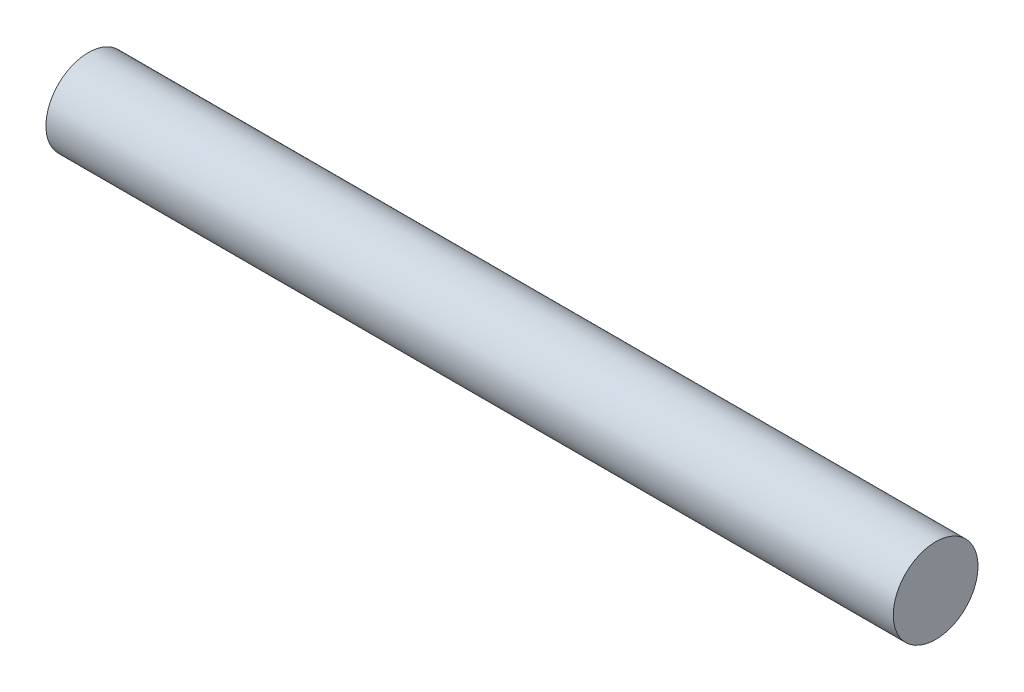
ISO-10303-21;
HEADER;
FILE_DESCRIPTION(('STEP AP214'),'2;1');
FILE_NAME('part.step','',(''),(''),'','','');
FILE_SCHEMA(('AUTOMOTIVE_DESIGN { 1 0 10303 214 1 1 1 1 }'));
ENDSEC;
DATA;
#1=APPLICATION_CONTEXT('core data for automotive mechanical design processes');
#2=APPLICATION_PROTOCOL_DEFINITION('international standard','automotive_design',2000,#1);
#3=PRODUCT_CONTEXT('',#1,'mechanical');
#4=PRODUCT('Part','Part','',(#3));
#5=PRODUCT_RELATED_PRODUCT_CATEGORY('part','',(#4));
#6=PRODUCT_DEFINITION_FORMATION('','',#4);
#7=PRODUCT_DEFINITION_CONTEXT('part definition',#1,'design');
#8=PRODUCT_DEFINITION('design','',#6,#7);
#9=PRODUCT_DEFINITION_SHAPE('','',#8);
#10=(LENGTH_UNIT() NAMED_UNIT(*) SI_UNIT(.MILLI.,.METRE.));
#11=(NAMED_UNIT(*) PLANE_ANGLE_UNIT() SI_UNIT($,.RADIAN.));
#12=(NAMED_UNIT(*) SI_UNIT($,.STERADIAN.) SOLID_ANGLE_UNIT());
#13=UNCERTAINTY_MEASURE_WITH_UNIT(LENGTH_MEASURE(1.E-05),#10,'distance_accuracy_value','');
#14=(GEOMETRIC_REPRESENTATION_CONTEXT(3) GLOBAL_UNCERTAINTY_ASSIGNED_CONTEXT((#13)) GLOBAL_UNIT_ASSIGNED_CONTEXT((#10,
#11,#12)) REPRESENTATION_CONTEXT('',''));
#15=CARTESIAN_POINT('',(0.,0.,0.));
#16=DIRECTION('',(0.,0.,1.));
#17=DIRECTION('',(1.,0.,0.));
#18=AXIS2_PLACEMENT_3D('',#15,#16,#17);
#19=CARTESIAN_POINT('',(15.,0.,0.));
#20=DIRECTION('',(-1.,0.,0.));
#21=DIRECTION('',(0.,0.,1.));
#22=AXIS2_PLACEMENT_3D('',#19,#20,#21);
#23=CYLINDRICAL_SURFACE('',#22,0.75);
#24=CARTESIAN_POINT('',(15.,0.,0.));
#25=DIRECTION('',(1.,0.,0.));
#26=DIRECTION('',(0.,0.,-1.));
#27=AXIS2_PLACEMENT_3D('',#24,#25,#26);
#28=CIRCLE('',#27,0.75);
#29=CARTESIAN_POINT('',(15.,0.,-0.75));
#30=VERTEX_POINT('',#29);
#31=EDGE_CURVE('E10',#30,#30,#28,.T.);
#32=ORIENTED_EDGE('',*,*,#31,.F.);
#33=EDGE_LOOP('',(#32));
#34=FACE_BOUND('',#33,.T.);
#35=CARTESIAN_POINT('',(0.,0.,0.));
#36=DIRECTION('',(1.,0.,0.));
#37=DIRECTION('',(0.,0.,-1.));
#38=AXIS2_PLACEMENT_3D('',#35,#36,#37);
#39=CIRCLE('',#38,0.75);
#40=CARTESIAN_POINT('',(0.,0.,-0.75));
#41=VERTEX_POINT('',#40);
#42=EDGE_CURVE('E35',#41,#41,#39,.T.);
#43=ORIENTED_EDGE('',*,*,#42,.T.);
#44=EDGE_LOOP('',(#43));
#45=FACE_BOUND('',#44,.T.);
#46=ADVANCED_FACE('F32',(#34,#45),#23,.T.);
#47=CARTESIAN_POINT('',(15.,0.,0.));
#48=DIRECTION('',(1.,0.,0.));
#49=DIRECTION('',(0.,0.,-1.));
#50=AXIS2_PLACEMENT_3D('',#47,#48,#49);
#51=PLANE('',#50);
#52=ORIENTED_EDGE('',*,*,#31,.T.);
#53=EDGE_LOOP('',(#52));
#54=FACE_BOUND('',#53,.T.);
#55=ADVANCED_FACE('F47',(#54),#51,.T.);
#56=CARTESIAN_POINT('',(0.,0.,0.));
#57=DIRECTION('',(1.,0.,0.));
#58=DIRECTION('',(0.,0.,-1.));
#59=AXIS2_PLACEMENT_3D('',#56,#57,#58);
#60=PLANE('',#59);
#61=ORIENTED_EDGE('',*,*,#42,.F.);
#62=EDGE_LOOP('',(#61));
#63=FACE_BOUND('',#62,.T.);
#64=ADVANCED_FACE('F45',(#63),#60,.F.);
#65=CLOSED_SHELL('',(#46,#55,#64));
#66=MANIFOLD_SOLID_BREP('B2',#65);
#67=ADVANCED_BREP_SHAPE_REPRESENTATION('',(#18,#66),#14);
#68=SHAPE_DEFINITION_REPRESENTATION(#9,#67);
ENDSEC;
END-ISO-10303-21;
